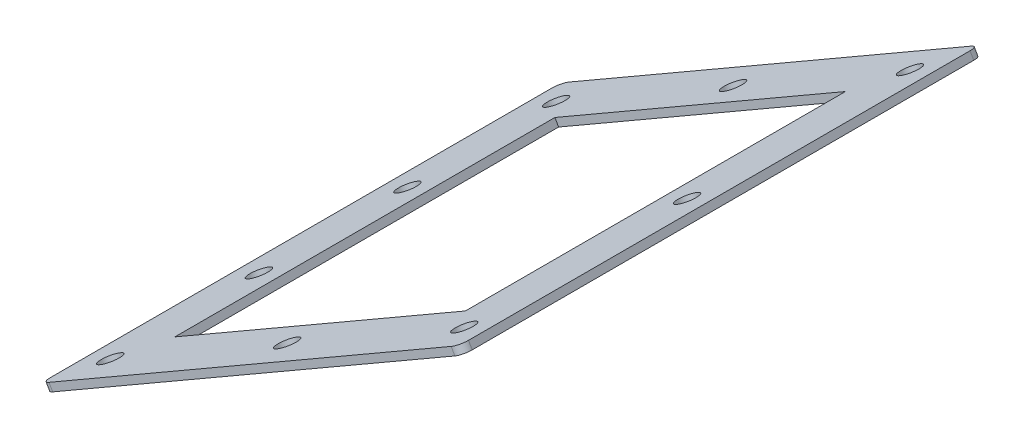
ISO-10303-21;
HEADER;
FILE_DESCRIPTION(('STEP AP214'),'2;1');
FILE_NAME('part.step','',(''),(''),'','','');
FILE_SCHEMA(('AUTOMOTIVE_DESIGN { 1 0 10303 214 1 1 1 1 }'));
ENDSEC;
DATA;
#1=APPLICATION_CONTEXT('core data for automotive mechanical design processes');
#2=APPLICATION_PROTOCOL_DEFINITION('international standard','automotive_design',2000,#1);
#3=PRODUCT_CONTEXT('',#1,'mechanical');
#4=PRODUCT('Part','Part','',(#3));
#5=PRODUCT_RELATED_PRODUCT_CATEGORY('part','',(#4));
#6=PRODUCT_DEFINITION_FORMATION('','',#4);
#7=PRODUCT_DEFINITION_CONTEXT('part definition',#1,'design');
#8=PRODUCT_DEFINITION('design','',#6,#7);
#9=PRODUCT_DEFINITION_SHAPE('','',#8);
#10=(LENGTH_UNIT() NAMED_UNIT(*) SI_UNIT(.MILLI.,.METRE.));
#11=(NAMED_UNIT(*) PLANE_ANGLE_UNIT() SI_UNIT($,.RADIAN.));
#12=(NAMED_UNIT(*) SI_UNIT($,.STERADIAN.) SOLID_ANGLE_UNIT());
#13=UNCERTAINTY_MEASURE_WITH_UNIT(LENGTH_MEASURE(1.E-05),#10,'distance_accuracy_value','');
#14=(GEOMETRIC_REPRESENTATION_CONTEXT(3) GLOBAL_UNCERTAINTY_ASSIGNED_CONTEXT((#13)) GLOBAL_UNIT_ASSIGNED_CONTEXT((#10,
#11,#12)) REPRESENTATION_CONTEXT('',''));
#15=CARTESIAN_POINT('',(0.,0.,0.));
#16=DIRECTION('',(0.,0.,1.));
#17=DIRECTION('',(1.,0.,0.));
#18=AXIS2_PLACEMENT_3D('',#15,#16,#17);
#19=CARTESIAN_POINT('',(1681.64736032422,3043.54507140033,140.));
#20=DIRECTION('',(0.866025403784435,0.500000000000006,0.));
#21=DIRECTION('',(0.,0.,-1.));
#22=AXIS2_PLACEMENT_3D('',#19,#20,#21);
#23=PLANE('',#22);
#24=DIRECTION('',(0.,0.,1.));
#25=VECTOR('',#24,1.);
#26=CARTESIAN_POINT('',(1683.64736032422,3040.0809697852,140.));
#27=LINE('',#26,#25);
#28=CARTESIAN_POINT('',(1683.64736032422,3040.0809697852,135.));
#29=VERTEX_POINT('',#28);
#30=CARTESIAN_POINT('',(1683.64736032422,3040.0809697852,-135.));
#31=VERTEX_POINT('',#30);
#32=EDGE_CURVE('E242',#29,#31,#27,.F.);
#33=ORIENTED_EDGE('',*,*,#32,.F.);
#34=DIRECTION('',(-0.500000000000006,0.866025403784435,0.));
#35=VECTOR('',#34,1.);
#36=CARTESIAN_POINT('',(1681.64736032422,3043.54507140033,135.));
#37=LINE('',#36,#35);
#38=CARTESIAN_POINT('',(1681.64736032422,3043.54507140033,135.));
#39=VERTEX_POINT('',#38);
#40=EDGE_CURVE('E274',#29,#39,#37,.T.);
#41=ORIENTED_EDGE('',*,*,#40,.T.);
#42=DIRECTION('',(0.,0.,-1.));
#43=VECTOR('',#42,1.);
#44=CARTESIAN_POINT('',(1681.64736032422,3043.54507140033,140.));
#45=LINE('',#44,#43);
#46=CARTESIAN_POINT('',(1681.64736032422,3043.54507140033,-135.));
#47=VERTEX_POINT('',#46);
#48=EDGE_CURVE('E230',#39,#47,#45,.T.);
#49=ORIENTED_EDGE('',*,*,#48,.T.);
#50=DIRECTION('',(0.500000000000006,-0.866025403784435,0.));
#51=VECTOR('',#50,1.);
#52=CARTESIAN_POINT('',(1681.64736032422,3043.54507140033,-135.));
#53=LINE('',#52,#51);
#54=EDGE_CURVE('E272',#47,#31,#53,.T.);
#55=ORIENTED_EDGE('',*,*,#54,.T.);
#56=EDGE_LOOP('',(#33,#41,#49,#55));
#57=FACE_BOUND('',#56,.T.);
#58=ADVANCED_FACE('F51',(#57),#23,.F.);
#59=CARTESIAN_POINT('',(1681.64736032422,3043.54507140033,140.));
#60=DIRECTION('',(0.,0.,1.));
#61=DIRECTION('',(0.866025403784435,0.500000000000006,0.));
#62=AXIS2_PLACEMENT_3D('',#59,#60,#61);
#63=PLANE('',#62);
#64=DIRECTION('',(-0.866025403784435,-0.500000000000006,0.));
#65=VECTOR('',#64,1.);
#66=CARTESIAN_POINT('',(1683.64736032422,3040.0809697852,140.));
#67=LINE('',#66,#65);
#68=CARTESIAN_POINT('',(1687.97748734315,3042.5809697852,140.));
#69=VERTEX_POINT('',#68);
#70=CARTESIAN_POINT('',(1904.48383828926,3167.5809697852,140.));
#71=VERTEX_POINT('',#70);
#72=EDGE_CURVE('E227',#69,#71,#67,.F.);
#73=ORIENTED_EDGE('',*,*,#72,.T.);
#74=DIRECTION('',(-0.500000000000006,0.866025403784435,0.));
#75=VECTOR('',#74,1.);
#76=CARTESIAN_POINT('',(1902.48383828926,3171.04507140033,140.));
#77=LINE('',#76,#75);
#78=CARTESIAN_POINT('',(1902.48383828926,3171.04507140033,140.));
#79=VERTEX_POINT('',#78);
#80=EDGE_CURVE('E248',#71,#79,#77,.T.);
#81=ORIENTED_EDGE('',*,*,#80,.T.);
#82=DIRECTION('',(0.866025403784435,0.500000000000006,0.));
#83=VECTOR('',#82,1.);
#84=CARTESIAN_POINT('',(1681.64736032422,3043.54507140033,140.));
#85=LINE('',#84,#83);
#86=CARTESIAN_POINT('',(1685.97748734315,3046.04507140033,140.));
#87=VERTEX_POINT('',#86);
#88=EDGE_CURVE('E233',#87,#79,#85,.T.);
#89=ORIENTED_EDGE('',*,*,#88,.F.);
#90=DIRECTION('',(0.500000000000006,-0.866025403784435,0.));
#91=VECTOR('',#90,1.);
#92=CARTESIAN_POINT('',(1685.97748734315,3046.04507140033,140.));
#93=LINE('',#92,#91);
#94=EDGE_CURVE('E236',#87,#69,#93,.T.);
#95=ORIENTED_EDGE('',*,*,#94,.T.);
#96=EDGE_LOOP('',(#73,#81,#89,#95));
#97=FACE_BOUND('',#96,.T.);
#98=ADVANCED_FACE('F305',(#97),#63,.T.);
#99=CARTESIAN_POINT('',(1906.81396530818,3173.54507140033,140.));
#100=DIRECTION('',(0.866025403784435,0.500000000000006,0.));
#101=DIRECTION('',(0.,0.,-1.));
#102=AXIS2_PLACEMENT_3D('',#99,#100,#101);
#103=PLANE('',#102);
#104=DIRECTION('',(0.,0.,-1.));
#105=VECTOR('',#104,1.);
#106=CARTESIAN_POINT('',(1906.81396530818,3173.54507140033,140.));
#107=LINE('',#106,#105);
#108=CARTESIAN_POINT('',(1906.81396530818,3173.54507140033,135.));
#109=VERTEX_POINT('',#108);
#110=CARTESIAN_POINT('',(1906.81396530818,3173.54507140033,-135.));
#111=VERTEX_POINT('',#110);
#112=EDGE_CURVE('E223',#109,#111,#107,.T.);
#113=ORIENTED_EDGE('',*,*,#112,.F.);
#114=DIRECTION('',(-0.500000000000006,0.866025403784435,0.));
#115=VECTOR('',#114,1.);
#116=CARTESIAN_POINT('',(1906.81396530818,3173.54507140033,135.));
#117=LINE('',#116,#115);
#118=CARTESIAN_POINT('',(1908.81396530818,3170.0809697852,135.));
#119=VERTEX_POINT('',#118);
#120=EDGE_CURVE('E262',#109,#119,#117,.F.);
#121=ORIENTED_EDGE('',*,*,#120,.T.);
#122=DIRECTION('',(0.,0.,1.));
#123=VECTOR('',#122,1.);
#124=CARTESIAN_POINT('',(1908.81396530818,3170.0809697852,140.));
#125=LINE('',#124,#123);
#126=CARTESIAN_POINT('',(1908.81396530818,3170.0809697852,-135.));
#127=VERTEX_POINT('',#126);
#128=EDGE_CURVE('E222',#119,#127,#125,.F.);
#129=ORIENTED_EDGE('',*,*,#128,.T.);
#130=DIRECTION('',(0.500000000000006,-0.866025403784435,0.));
#131=VECTOR('',#130,1.);
#132=CARTESIAN_POINT('',(1906.81396530818,3173.54507140033,-135.));
#133=LINE('',#132,#131);
#134=EDGE_CURVE('E259',#127,#111,#133,.F.);
#135=ORIENTED_EDGE('',*,*,#134,.T.);
#136=EDGE_LOOP('',(#113,#121,#129,#135));
#137=FACE_BOUND('',#136,.T.);
#138=ADVANCED_FACE('F311',(#137),#103,.T.);
#139=CARTESIAN_POINT('',(1681.64736032422,3043.54507140033,-140.));
#140=DIRECTION('',(0.,0.,1.));
#141=DIRECTION('',(0.866025403784435,0.500000000000006,0.));
#142=AXIS2_PLACEMENT_3D('',#139,#140,#141);
#143=PLANE('',#142);
#144=DIRECTION('',(-0.866025403784435,-0.500000000000006,0.));
#145=VECTOR('',#144,1.);
#146=CARTESIAN_POINT('',(1683.64736032422,3040.0809697852,-140.));
#147=LINE('',#146,#145);
#148=CARTESIAN_POINT('',(1687.97748734315,3042.5809697852,-140.));
#149=VERTEX_POINT('',#148);
#150=CARTESIAN_POINT('',(1904.48383828926,3167.5809697852,-140.));
#151=VERTEX_POINT('',#150);
#152=EDGE_CURVE('E239',#149,#151,#147,.F.);
#153=ORIENTED_EDGE('',*,*,#152,.F.);
#154=DIRECTION('',(0.500000000000006,-0.866025403784435,0.));
#155=VECTOR('',#154,1.);
#156=CARTESIAN_POINT('',(1685.97748734315,3046.04507140033,-140.));
#157=LINE('',#156,#155);
#158=CARTESIAN_POINT('',(1685.97748734315,3046.04507140033,-140.));
#159=VERTEX_POINT('',#158);
#160=EDGE_CURVE('E279',#149,#159,#157,.F.);
#161=ORIENTED_EDGE('',*,*,#160,.T.);
#162=DIRECTION('',(0.866025403784435,0.500000000000006,0.));
#163=VECTOR('',#162,1.);
#164=CARTESIAN_POINT('',(1681.64736032422,3043.54507140033,-140.));
#165=LINE('',#164,#163);
#166=CARTESIAN_POINT('',(1902.48383828926,3171.04507140033,-140.));
#167=VERTEX_POINT('',#166);
#168=EDGE_CURVE('E226',#159,#167,#165,.T.);
#169=ORIENTED_EDGE('',*,*,#168,.T.);
#170=DIRECTION('',(-0.500000000000006,0.866025403784435,0.));
#171=VECTOR('',#170,1.);
#172=CARTESIAN_POINT('',(1902.48383828926,3171.04507140033,-140.));
#173=LINE('',#172,#171);
#174=EDGE_CURVE('E277',#167,#151,#173,.F.);
#175=ORIENTED_EDGE('',*,*,#174,.T.);
#176=EDGE_LOOP('',(#153,#161,#169,#175));
#177=FACE_BOUND('',#176,.T.);
#178=ADVANCED_FACE('F317',(#177),#143,.F.);
#179=CARTESIAN_POINT('',(1681.64736032422,3043.54507140033,140.));
#180=DIRECTION('',(-0.500000000000006,0.866025403784435,0.));
#181=DIRECTION('',(-0.866025403784435,-0.500000000000006,0.));
#182=AXIS2_PLACEMENT_3D('',#179,#180,#181);
#183=PLANE('',#182);
#184=DIRECTION('',(-0.866025403784435,-0.500000000000005,0.));
#185=VECTOR('',#184,1.);
#186=CARTESIAN_POINT('',(1716.02856885446,3063.39507140033,-102.3));
#187=LINE('',#186,#185);
#188=CARTESIAN_POINT('',(1872.43275677793,3153.69507140033,-102.3));
#189=VERTEX_POINT('',#188);
#190=CARTESIAN_POINT('',(1716.02856885446,3063.39507140033,-102.3));
#191=VERTEX_POINT('',#190);
#192=EDGE_CURVE('E66',#189,#191,#187,.T.);
#193=ORIENTED_EDGE('',*,*,#192,.F.);
#194=DIRECTION('',(0.,0.,-1.));
#195=VECTOR('',#194,1.);
#196=CARTESIAN_POINT('',(1872.43275677793,3153.69507140033,-102.3));
#197=LINE('',#196,#195);
#198=CARTESIAN_POINT('',(1872.43275677793,3153.69507140033,102.3));
#199=VERTEX_POINT('',#198);
#200=EDGE_CURVE('E159',#199,#189,#197,.T.);
#201=ORIENTED_EDGE('',*,*,#200,.F.);
#202=DIRECTION('',(0.866025403784435,0.500000000000005,0.));
#203=VECTOR('',#202,1.);
#204=CARTESIAN_POINT('',(1716.02856885446,3063.39507140033,102.3));
#205=LINE('',#204,#203);
#206=CARTESIAN_POINT('',(1716.02856885446,3063.39507140033,102.3));
#207=VERTEX_POINT('',#206);
#208=EDGE_CURVE('E143',#207,#199,#205,.T.);
#209=ORIENTED_EDGE('',*,*,#208,.F.);
#210=DIRECTION('',(0.,0.,1.));
#211=VECTOR('',#210,1.);
#212=CARTESIAN_POINT('',(1716.02856885446,3063.39507140033,-102.3));
#213=LINE('',#212,#211);
#214=EDGE_CURVE('E152',#191,#207,#213,.T.);
#215=ORIENTED_EDGE('',*,*,#214,.F.);
#216=EDGE_LOOP('',(#193,#201,#209,#215));
#217=FACE_BOUND('',#216,.T.);
#218=CARTESIAN_POINT('',(1698.96786839991,3053.54507140033,120.));
#219=DIRECTION('',(-0.500000000000006,0.866025403784435,0.));
#220=DIRECTION('',(-0.866025403784435,-0.500000000000006,0.));
#221=AXIS2_PLACEMENT_3D('',#218,#219,#220);
#222=CIRCLE('',#221,5.60000000000001);
#223=CARTESIAN_POINT('',(1694.11812613872,3050.74507140033,120.));
#224=VERTEX_POINT('',#223);
#225=EDGE_CURVE('E166',#224,#224,#222,.T.);
#226=ORIENTED_EDGE('',*,*,#225,.F.);
#227=EDGE_LOOP('',(#226));
#228=FACE_BOUND('',#227,.T.);
#229=CARTESIAN_POINT('',(1698.96786839991,3053.54507140033,40.));
#230=DIRECTION('',(-0.500000000000006,0.866025403784435,0.));
#231=DIRECTION('',(-0.866025403784435,-0.500000000000006,0.));
#232=AXIS2_PLACEMENT_3D('',#229,#230,#231);
#233=CIRCLE('',#232,5.59999999999999);
#234=CARTESIAN_POINT('',(1694.11812613872,3050.74507140033,40.));
#235=VERTEX_POINT('',#234);
#236=EDGE_CURVE('E174',#235,#235,#233,.T.);
#237=ORIENTED_EDGE('',*,*,#236,.F.);
#238=EDGE_LOOP('',(#237));
#239=FACE_BOUND('',#238,.T.);
#240=CARTESIAN_POINT('',(1698.96786839991,3053.54507140033,-40.));
#241=DIRECTION('',(-0.500000000000006,0.866025403784435,0.));
#242=DIRECTION('',(-0.866025403784435,-0.500000000000006,0.));
#243=AXIS2_PLACEMENT_3D('',#240,#241,#242);
#244=CIRCLE('',#243,5.59999999999999);
#245=CARTESIAN_POINT('',(1694.11812613872,3050.74507140033,-40.));
#246=VERTEX_POINT('',#245);
#247=EDGE_CURVE('E180',#246,#246,#244,.T.);
#248=ORIENTED_EDGE('',*,*,#247,.F.);
#249=EDGE_LOOP('',(#248));
#250=FACE_BOUND('',#249,.T.);
#251=CARTESIAN_POINT('',(1794.2306628162,3108.54507140033,-120.));
#252=DIRECTION('',(-0.500000000000006,0.866025403784435,0.));
#253=DIRECTION('',(-0.866025403784435,-0.500000000000006,0.));
#254=AXIS2_PLACEMENT_3D('',#251,#252,#253);
#255=CIRCLE('',#254,5.59999999999999);
#256=CARTESIAN_POINT('',(1789.38092055501,3105.74507140033,-120.));
#257=VERTEX_POINT('',#256);
#258=EDGE_CURVE('E186',#257,#257,#255,.T.);
#259=ORIENTED_EDGE('',*,*,#258,.F.);
#260=EDGE_LOOP('',(#259));
#261=FACE_BOUND('',#260,.T.);
#262=CARTESIAN_POINT('',(1698.96786839991,3053.54507140033,-120.));
#263=DIRECTION('',(-0.500000000000006,0.866025403784435,0.));
#264=DIRECTION('',(-0.866025403784435,-0.500000000000006,0.));
#265=AXIS2_PLACEMENT_3D('',#262,#263,#264);
#266=CIRCLE('',#265,5.59999999999999);
#267=CARTESIAN_POINT('',(1694.11812613872,3050.74507140033,-120.));
#268=VERTEX_POINT('',#267);
#269=EDGE_CURVE('E192',#268,#268,#266,.T.);
#270=ORIENTED_EDGE('',*,*,#269,.F.);
#271=EDGE_LOOP('',(#270));
#272=FACE_BOUND('',#271,.T.);
#273=CARTESIAN_POINT('',(1889.49345723249,3163.54507140033,-120.));
#274=DIRECTION('',(-0.500000000000006,0.866025403784435,0.));
#275=DIRECTION('',(-0.866025403784435,-0.500000000000006,0.));
#276=AXIS2_PLACEMENT_3D('',#273,#274,#275);
#277=CIRCLE('',#276,5.59999999999999);
#278=CARTESIAN_POINT('',(1884.6437149713,3160.74507140033,-120.));
#279=VERTEX_POINT('',#278);
#280=EDGE_CURVE('E198',#279,#279,#277,.T.);
#281=ORIENTED_EDGE('',*,*,#280,.F.);
#282=EDGE_LOOP('',(#281));
#283=FACE_BOUND('',#282,.T.);
#284=CARTESIAN_POINT('',(1889.49345723249,3163.54507140033,0.));
#285=DIRECTION('',(-0.500000000000006,0.866025403784435,0.));
#286=DIRECTION('',(-0.866025403784435,-0.500000000000006,0.));
#287=AXIS2_PLACEMENT_3D('',#284,#285,#286);
#288=CIRCLE('',#287,5.59999999999999);
#289=CARTESIAN_POINT('',(1884.6437149713,3160.74507140033,0.));
#290=VERTEX_POINT('',#289);
#291=EDGE_CURVE('E204',#290,#290,#288,.T.);
#292=ORIENTED_EDGE('',*,*,#291,.F.);
#293=EDGE_LOOP('',(#292));
#294=FACE_BOUND('',#293,.T.);
#295=CARTESIAN_POINT('',(1889.49345723249,3163.54507140033,120.));
#296=DIRECTION('',(-0.500000000000006,0.866025403784435,0.));
#297=DIRECTION('',(-0.866025403784435,-0.500000000000006,0.));
#298=AXIS2_PLACEMENT_3D('',#295,#296,#297);
#299=CIRCLE('',#298,5.60000000000001);
#300=CARTESIAN_POINT('',(1884.6437149713,3160.74507140033,120.));
#301=VERTEX_POINT('',#300);
#302=EDGE_CURVE('E210',#301,#301,#299,.T.);
#303=ORIENTED_EDGE('',*,*,#302,.F.);
#304=EDGE_LOOP('',(#303));
#305=FACE_BOUND('',#304,.T.);
#306=CARTESIAN_POINT('',(1794.2306628162,3108.54507140033,120.));
#307=DIRECTION('',(-0.500000000000006,0.866025403784435,0.));
#308=DIRECTION('',(-0.866025403784435,-0.500000000000006,0.));
#309=AXIS2_PLACEMENT_3D('',#306,#307,#308);
#310=CIRCLE('',#309,5.60000000000001);
#311=CARTESIAN_POINT('',(1789.38092055501,3105.74507140033,120.));
#312=VERTEX_POINT('',#311);
#313=EDGE_CURVE('E216',#312,#312,#310,.T.);
#314=ORIENTED_EDGE('',*,*,#313,.F.);
#315=EDGE_LOOP('',(#314));
#316=FACE_BOUND('',#315,.T.);
#317=ORIENTED_EDGE('',*,*,#88,.T.);
#318=CARTESIAN_POINT('',(1902.48383828926,3171.04507140033,135.));
#319=DIRECTION('',(-0.500000000000006,0.866025403784435,0.));
#320=DIRECTION('',(-0.866025403784435,-0.500000000000006,0.));
#321=AXIS2_PLACEMENT_3D('',#318,#319,#320);
#322=CIRCLE('',#321,5.);
#323=EDGE_CURVE('E257',#79,#109,#322,.T.);
#324=ORIENTED_EDGE('',*,*,#323,.T.);
#325=ORIENTED_EDGE('',*,*,#112,.T.);
#326=CARTESIAN_POINT('',(1902.48383828926,3171.04507140033,-135.));
#327=DIRECTION('',(-0.500000000000006,0.866025403784435,0.));
#328=DIRECTION('',(-0.866025403784435,-0.500000000000006,0.));
#329=AXIS2_PLACEMENT_3D('',#326,#327,#328);
#330=CIRCLE('',#329,5.);
#331=EDGE_CURVE('E251',#111,#167,#330,.T.);
#332=ORIENTED_EDGE('',*,*,#331,.T.);
#333=ORIENTED_EDGE('',*,*,#168,.F.);
#334=CARTESIAN_POINT('',(1685.97748734315,3046.04507140033,-135.));
#335=DIRECTION('',(-0.500000000000006,0.866025403784435,0.));
#336=DIRECTION('',(-0.866025403784435,-0.500000000000006,0.));
#337=AXIS2_PLACEMENT_3D('',#334,#335,#336);
#338=CIRCLE('',#337,5.);
#339=EDGE_CURVE('E253',#159,#47,#338,.T.);
#340=ORIENTED_EDGE('',*,*,#339,.T.);
#341=ORIENTED_EDGE('',*,*,#48,.F.);
#342=CARTESIAN_POINT('',(1685.97748734315,3046.04507140033,135.));
#343=DIRECTION('',(-0.500000000000006,0.866025403784435,0.));
#344=DIRECTION('',(-0.866025403784435,-0.500000000000006,0.));
#345=AXIS2_PLACEMENT_3D('',#342,#343,#344);
#346=CIRCLE('',#345,5.);
#347=EDGE_CURVE('E255',#39,#87,#346,.T.);
#348=ORIENTED_EDGE('',*,*,#347,.T.);
#349=EDGE_LOOP('',(#317,#324,#325,#332,#333,#340,#341,#348));
#350=FACE_BOUND('',#349,.T.);
#351=ADVANCED_FACE('F156',(#217,#228,#239,#250,#261,#272,#283,#294,#305,#316,#350),#183,.T.);
#352=CARTESIAN_POINT('',(1683.64736032422,3040.0809697852,140.));
#353=DIRECTION('',(-0.500000000000006,0.866025403784435,0.));
#354=DIRECTION('',(-0.866025403784435,-0.500000000000006,0.));
#355=AXIS2_PLACEMENT_3D('',#352,#353,#354);
#356=PLANE('',#355);
#357=DIRECTION('',(0.,0.,-1.));
#358=VECTOR('',#357,1.);
#359=CARTESIAN_POINT('',(1874.43275677793,3150.23096978519,140.));
#360=LINE('',#359,#358);
#361=CARTESIAN_POINT('',(1874.43275677793,3150.23096978519,102.3));
#362=VERTEX_POINT('',#361);
#363=CARTESIAN_POINT('',(1874.43275677793,3150.23096978519,-102.3));
#364=VERTEX_POINT('',#363);
#365=EDGE_CURVE('E59',#362,#364,#360,.T.);
#366=ORIENTED_EDGE('',*,*,#365,.T.);
#367=DIRECTION('',(-0.866025403784435,-0.500000000000006,0.));
#368=VECTOR('',#367,1.);
#369=CARTESIAN_POINT('',(1683.64736032422,3040.0809697852,-102.3));
#370=LINE('',#369,#368);
#371=CARTESIAN_POINT('',(1718.02856885446,3059.93096978519,-102.3));
#372=VERTEX_POINT('',#371);
#373=EDGE_CURVE('E13',#364,#372,#370,.T.);
#374=ORIENTED_EDGE('',*,*,#373,.T.);
#375=DIRECTION('',(0.,0.,1.));
#376=VECTOR('',#375,1.);
#377=CARTESIAN_POINT('',(1718.02856885446,3059.93096978519,140.));
#378=LINE('',#377,#376);
#379=CARTESIAN_POINT('',(1718.02856885446,3059.93096978519,102.3));
#380=VERTEX_POINT('',#379);
#381=EDGE_CURVE('E282',#372,#380,#378,.T.);
#382=ORIENTED_EDGE('',*,*,#381,.T.);
#383=DIRECTION('',(0.866025403784435,0.500000000000006,0.));
#384=VECTOR('',#383,1.);
#385=CARTESIAN_POINT('',(1683.64736032422,3040.0809697852,102.3));
#386=LINE('',#385,#384);
#387=EDGE_CURVE('E146',#380,#362,#386,.T.);
#388=ORIENTED_EDGE('',*,*,#387,.T.);
#389=EDGE_LOOP('',(#366,#374,#382,#388));
#390=FACE_BOUND('',#389,.T.);
#391=CARTESIAN_POINT('',(1700.96786839991,3050.08096978519,120.));
#392=DIRECTION('',(-0.500000000000006,0.866025403784435,0.));
#393=DIRECTION('',(-0.866025403784435,-0.500000000000006,0.));
#394=AXIS2_PLACEMENT_3D('',#391,#392,#393);
#395=CIRCLE('',#394,5.59999999999999);
#396=CARTESIAN_POINT('',(1696.11812613872,3047.28096978519,120.));
#397=VERTEX_POINT('',#396);
#398=EDGE_CURVE('E171',#397,#397,#395,.T.);
#399=ORIENTED_EDGE('',*,*,#398,.T.);
#400=EDGE_LOOP('',(#399));
#401=FACE_BOUND('',#400,.T.);
#402=CARTESIAN_POINT('',(1700.96786839991,3050.08096978519,40.));
#403=DIRECTION('',(-0.500000000000006,0.866025403784435,0.));
#404=DIRECTION('',(-0.866025403784435,-0.500000000000006,0.));
#405=AXIS2_PLACEMENT_3D('',#402,#403,#404);
#406=CIRCLE('',#405,5.59999999999999);
#407=CARTESIAN_POINT('',(1696.11812613872,3047.28096978519,40.));
#408=VERTEX_POINT('',#407);
#409=EDGE_CURVE('E177',#408,#408,#406,.T.);
#410=ORIENTED_EDGE('',*,*,#409,.T.);
#411=EDGE_LOOP('',(#410));
#412=FACE_BOUND('',#411,.T.);
#413=CARTESIAN_POINT('',(1700.96786839991,3050.08096978519,-40.));
#414=DIRECTION('',(-0.500000000000006,0.866025403784435,0.));
#415=DIRECTION('',(-0.866025403784435,-0.500000000000006,0.));
#416=AXIS2_PLACEMENT_3D('',#413,#414,#415);
#417=CIRCLE('',#416,5.59999999999999);
#418=CARTESIAN_POINT('',(1696.11812613872,3047.28096978519,-40.));
#419=VERTEX_POINT('',#418);
#420=EDGE_CURVE('E183',#419,#419,#417,.T.);
#421=ORIENTED_EDGE('',*,*,#420,.T.);
#422=EDGE_LOOP('',(#421));
#423=FACE_BOUND('',#422,.T.);
#424=CARTESIAN_POINT('',(1796.2306628162,3105.0809697852,-120.));
#425=DIRECTION('',(-0.500000000000006,0.866025403784435,0.));
#426=DIRECTION('',(-0.866025403784435,-0.500000000000006,0.));
#427=AXIS2_PLACEMENT_3D('',#424,#425,#426);
#428=CIRCLE('',#427,5.59999999999999);
#429=CARTESIAN_POINT('',(1791.38092055501,3102.2809697852,-120.));
#430=VERTEX_POINT('',#429);
#431=EDGE_CURVE('E189',#430,#430,#428,.T.);
#432=ORIENTED_EDGE('',*,*,#431,.T.);
#433=EDGE_LOOP('',(#432));
#434=FACE_BOUND('',#433,.T.);
#435=CARTESIAN_POINT('',(1700.96786839991,3050.08096978519,-120.));
#436=DIRECTION('',(-0.500000000000006,0.866025403784435,0.));
#437=DIRECTION('',(-0.866025403784435,-0.500000000000006,0.));
#438=AXIS2_PLACEMENT_3D('',#435,#436,#437);
#439=CIRCLE('',#438,5.59999999999999);
#440=CARTESIAN_POINT('',(1696.11812613872,3047.28096978519,-120.));
#441=VERTEX_POINT('',#440);
#442=EDGE_CURVE('E195',#441,#441,#439,.T.);
#443=ORIENTED_EDGE('',*,*,#442,.T.);
#444=EDGE_LOOP('',(#443));
#445=FACE_BOUND('',#444,.T.);
#446=CARTESIAN_POINT('',(1891.49345723249,3160.0809697852,-120.));
#447=DIRECTION('',(-0.500000000000006,0.866025403784435,0.));
#448=DIRECTION('',(-0.866025403784435,-0.500000000000006,0.));
#449=AXIS2_PLACEMENT_3D('',#446,#447,#448);
#450=CIRCLE('',#449,5.59999999999999);
#451=CARTESIAN_POINT('',(1886.6437149713,3157.2809697852,-120.));
#452=VERTEX_POINT('',#451);
#453=EDGE_CURVE('E201',#452,#452,#450,.T.);
#454=ORIENTED_EDGE('',*,*,#453,.T.);
#455=EDGE_LOOP('',(#454));
#456=FACE_BOUND('',#455,.T.);
#457=CARTESIAN_POINT('',(1891.49345723249,3160.0809697852,0.));
#458=DIRECTION('',(-0.500000000000006,0.866025403784435,0.));
#459=DIRECTION('',(-0.866025403784435,-0.500000000000006,0.));
#460=AXIS2_PLACEMENT_3D('',#457,#458,#459);
#461=CIRCLE('',#460,5.59999999999999);
#462=CARTESIAN_POINT('',(1886.6437149713,3157.2809697852,0.));
#463=VERTEX_POINT('',#462);
#464=EDGE_CURVE('E207',#463,#463,#461,.T.);
#465=ORIENTED_EDGE('',*,*,#464,.T.);
#466=EDGE_LOOP('',(#465));
#467=FACE_BOUND('',#466,.T.);
#468=CARTESIAN_POINT('',(1891.49345723249,3160.0809697852,120.));
#469=DIRECTION('',(-0.500000000000006,0.866025403784435,0.));
#470=DIRECTION('',(-0.866025403784435,-0.500000000000006,0.));
#471=AXIS2_PLACEMENT_3D('',#468,#469,#470);
#472=CIRCLE('',#471,5.59999999999999);
#473=CARTESIAN_POINT('',(1886.6437149713,3157.2809697852,120.));
#474=VERTEX_POINT('',#473);
#475=EDGE_CURVE('E213',#474,#474,#472,.T.);
#476=ORIENTED_EDGE('',*,*,#475,.T.);
#477=EDGE_LOOP('',(#476));
#478=FACE_BOUND('',#477,.T.);
#479=CARTESIAN_POINT('',(1796.2306628162,3105.0809697852,120.));
#480=DIRECTION('',(-0.500000000000006,0.866025403784435,0.));
#481=DIRECTION('',(-0.866025403784435,-0.500000000000006,0.));
#482=AXIS2_PLACEMENT_3D('',#479,#480,#481);
#483=CIRCLE('',#482,5.59999999999999);
#484=CARTESIAN_POINT('',(1791.38092055501,3102.2809697852,120.));
#485=VERTEX_POINT('',#484);
#486=EDGE_CURVE('E219',#485,#485,#483,.T.);
#487=ORIENTED_EDGE('',*,*,#486,.T.);
#488=EDGE_LOOP('',(#487));
#489=FACE_BOUND('',#488,.T.);
#490=ORIENTED_EDGE('',*,*,#128,.F.);
#491=CARTESIAN_POINT('',(1904.48383828926,3167.5809697852,135.));
#492=DIRECTION('',(-0.500000000000006,0.866025403784435,0.));
#493=DIRECTION('',(-0.866025403784435,-0.500000000000006,0.));
#494=AXIS2_PLACEMENT_3D('',#491,#492,#493);
#495=CIRCLE('',#494,5.);
#496=EDGE_CURVE('E270',#119,#71,#495,.F.);
#497=ORIENTED_EDGE('',*,*,#496,.T.);
#498=ORIENTED_EDGE('',*,*,#72,.F.);
#499=CARTESIAN_POINT('',(1687.97748734315,3042.5809697852,135.));
#500=DIRECTION('',(-0.500000000000006,0.866025403784435,0.));
#501=DIRECTION('',(-0.866025403784435,-0.500000000000006,0.));
#502=AXIS2_PLACEMENT_3D('',#499,#500,#501);
#503=CIRCLE('',#502,5.);
#504=EDGE_CURVE('E268',#69,#29,#503,.F.);
#505=ORIENTED_EDGE('',*,*,#504,.T.);
#506=ORIENTED_EDGE('',*,*,#32,.T.);
#507=CARTESIAN_POINT('',(1687.97748734315,3042.5809697852,-135.));
#508=DIRECTION('',(-0.500000000000006,0.866025403784435,0.));
#509=DIRECTION('',(-0.866025403784435,-0.500000000000006,0.));
#510=AXIS2_PLACEMENT_3D('',#507,#508,#509);
#511=CIRCLE('',#510,5.);
#512=EDGE_CURVE('E266',#31,#149,#511,.F.);
#513=ORIENTED_EDGE('',*,*,#512,.T.);
#514=ORIENTED_EDGE('',*,*,#152,.T.);
#515=CARTESIAN_POINT('',(1904.48383828926,3167.5809697852,-135.));
#516=DIRECTION('',(-0.500000000000006,0.866025403784435,0.));
#517=DIRECTION('',(-0.866025403784435,-0.500000000000006,0.));
#518=AXIS2_PLACEMENT_3D('',#515,#516,#517);
#519=CIRCLE('',#518,5.);
#520=EDGE_CURVE('E264',#151,#127,#519,.F.);
#521=ORIENTED_EDGE('',*,*,#520,.T.);
#522=EDGE_LOOP('',(#490,#497,#498,#505,#506,#513,#514,#521));
#523=FACE_BOUND('',#522,.T.);
#524=ADVANCED_FACE('F286',(#390,#401,#412,#423,#434,#445,#456,#467,#478,#489,#523),#356,.F.);
#525=CARTESIAN_POINT('',(1902.48383828926,3171.04507140033,135.));
#526=DIRECTION('',(-0.500000000000006,0.866025403784435,0.));
#527=DIRECTION('',(-0.866025403784435,-0.500000000000006,0.));
#528=AXIS2_PLACEMENT_3D('',#525,#526,#527);
#529=CYLINDRICAL_SURFACE('',#528,5.);
#530=ORIENTED_EDGE('',*,*,#496,.F.);
#531=ORIENTED_EDGE('',*,*,#120,.F.);
#532=ORIENTED_EDGE('',*,*,#323,.F.);
#533=ORIENTED_EDGE('',*,*,#80,.F.);
#534=EDGE_LOOP('',(#530,#531,#532,#533));
#535=FACE_BOUND('',#534,.T.);
#536=ADVANCED_FACE('F321',(#535),#529,.T.);
#537=CARTESIAN_POINT('',(1685.97748734315,3046.04507140033,135.));
#538=DIRECTION('',(0.500000000000006,-0.866025403784435,0.));
#539=DIRECTION('',(0.866025403784435,0.500000000000006,0.));
#540=AXIS2_PLACEMENT_3D('',#537,#538,#539);
#541=CYLINDRICAL_SURFACE('',#540,5.);
#542=ORIENTED_EDGE('',*,*,#504,.F.);
#543=ORIENTED_EDGE('',*,*,#94,.F.);
#544=ORIENTED_EDGE('',*,*,#347,.F.);
#545=ORIENTED_EDGE('',*,*,#40,.F.);
#546=EDGE_LOOP('',(#542,#543,#544,#545));
#547=FACE_BOUND('',#546,.T.);
#548=ADVANCED_FACE('F324',(#547),#541,.T.);
#549=CARTESIAN_POINT('',(1685.97748734315,3046.04507140033,-135.));
#550=DIRECTION('',(-0.500000000000006,0.866025403784435,0.));
#551=DIRECTION('',(-0.866025403784435,-0.500000000000006,0.));
#552=AXIS2_PLACEMENT_3D('',#549,#550,#551);
#553=CYLINDRICAL_SURFACE('',#552,5.);
#554=ORIENTED_EDGE('',*,*,#512,.F.);
#555=ORIENTED_EDGE('',*,*,#54,.F.);
#556=ORIENTED_EDGE('',*,*,#339,.F.);
#557=ORIENTED_EDGE('',*,*,#160,.F.);
#558=EDGE_LOOP('',(#554,#555,#556,#557));
#559=FACE_BOUND('',#558,.T.);
#560=ADVANCED_FACE('F327',(#559),#553,.T.);
#561=CARTESIAN_POINT('',(1902.48383828926,3171.04507140033,-135.));
#562=DIRECTION('',(0.500000000000006,-0.866025403784435,0.));
#563=DIRECTION('',(0.866025403784435,0.500000000000006,0.));
#564=AXIS2_PLACEMENT_3D('',#561,#562,#563);
#565=CYLINDRICAL_SURFACE('',#564,5.);
#566=ORIENTED_EDGE('',*,*,#520,.F.);
#567=ORIENTED_EDGE('',*,*,#174,.F.);
#568=ORIENTED_EDGE('',*,*,#331,.F.);
#569=ORIENTED_EDGE('',*,*,#134,.F.);
#570=EDGE_LOOP('',(#566,#567,#568,#569));
#571=FACE_BOUND('',#570,.T.);
#572=ADVANCED_FACE('F53',(#571),#565,.T.);
#573=CARTESIAN_POINT('',(1794.2306628162,3108.54507140033,120.));
#574=DIRECTION('',(-0.500000000000006,0.866025403784435,0.));
#575=DIRECTION('',(-0.866025403784435,-0.500000000000006,0.));
#576=AXIS2_PLACEMENT_3D('',#573,#574,#575);
#577=CYLINDRICAL_SURFACE('',#576,5.59999999999999);
#578=ORIENTED_EDGE('',*,*,#313,.T.);
#579=EDGE_LOOP('',(#578));
#580=FACE_BOUND('',#579,.T.);
#581=ORIENTED_EDGE('',*,*,#486,.F.);
#582=EDGE_LOOP('',(#581));
#583=FACE_BOUND('',#582,.T.);
#584=ADVANCED_FACE('F334',(#580,#583),#577,.F.);
#585=CARTESIAN_POINT('',(1889.49345723249,3163.54507140033,120.));
#586=DIRECTION('',(-0.500000000000006,0.866025403784435,0.));
#587=DIRECTION('',(-0.866025403784435,-0.500000000000006,0.));
#588=AXIS2_PLACEMENT_3D('',#585,#586,#587);
#589=CYLINDRICAL_SURFACE('',#588,5.59999999999999);
#590=ORIENTED_EDGE('',*,*,#302,.T.);
#591=EDGE_LOOP('',(#590));
#592=FACE_BOUND('',#591,.T.);
#593=ORIENTED_EDGE('',*,*,#475,.F.);
#594=EDGE_LOOP('',(#593));
#595=FACE_BOUND('',#594,.T.);
#596=ADVANCED_FACE('F418',(#592,#595),#589,.F.);
#597=CARTESIAN_POINT('',(1889.49345723249,3163.54507140033,0.));
#598=DIRECTION('',(-0.500000000000006,0.866025403784435,0.));
#599=DIRECTION('',(-0.866025403784435,-0.500000000000006,0.));
#600=AXIS2_PLACEMENT_3D('',#597,#598,#599);
#601=CYLINDRICAL_SURFACE('',#600,5.59999999999999);
#602=ORIENTED_EDGE('',*,*,#291,.T.);
#603=EDGE_LOOP('',(#602));
#604=FACE_BOUND('',#603,.T.);
#605=ORIENTED_EDGE('',*,*,#464,.F.);
#606=EDGE_LOOP('',(#605));
#607=FACE_BOUND('',#606,.T.);
#608=ADVANCED_FACE('F427',(#604,#607),#601,.F.);
#609=CARTESIAN_POINT('',(1889.49345723249,3163.54507140033,-120.));
#610=DIRECTION('',(-0.500000000000006,0.866025403784435,0.));
#611=DIRECTION('',(-0.866025403784435,-0.500000000000006,0.));
#612=AXIS2_PLACEMENT_3D('',#609,#610,#611);
#613=CYLINDRICAL_SURFACE('',#612,5.59999999999999);
#614=ORIENTED_EDGE('',*,*,#280,.T.);
#615=EDGE_LOOP('',(#614));
#616=FACE_BOUND('',#615,.T.);
#617=ORIENTED_EDGE('',*,*,#453,.F.);
#618=EDGE_LOOP('',(#617));
#619=FACE_BOUND('',#618,.T.);
#620=ADVANCED_FACE('F436',(#616,#619),#613,.F.);
#621=CARTESIAN_POINT('',(1698.96786839991,3053.54507140033,-120.));
#622=DIRECTION('',(-0.500000000000006,0.866025403784435,0.));
#623=DIRECTION('',(-0.866025403784435,-0.500000000000006,0.));
#624=AXIS2_PLACEMENT_3D('',#621,#622,#623);
#625=CYLINDRICAL_SURFACE('',#624,5.59999999999999);
#626=ORIENTED_EDGE('',*,*,#269,.T.);
#627=EDGE_LOOP('',(#626));
#628=FACE_BOUND('',#627,.T.);
#629=ORIENTED_EDGE('',*,*,#442,.F.);
#630=EDGE_LOOP('',(#629));
#631=FACE_BOUND('',#630,.T.);
#632=ADVANCED_FACE('F446',(#628,#631),#625,.F.);
#633=CARTESIAN_POINT('',(1794.2306628162,3108.54507140033,-120.));
#634=DIRECTION('',(-0.500000000000006,0.866025403784435,0.));
#635=DIRECTION('',(-0.866025403784435,-0.500000000000006,0.));
#636=AXIS2_PLACEMENT_3D('',#633,#634,#635);
#637=CYLINDRICAL_SURFACE('',#636,5.59999999999999);
#638=ORIENTED_EDGE('',*,*,#258,.T.);
#639=EDGE_LOOP('',(#638));
#640=FACE_BOUND('',#639,.T.);
#641=ORIENTED_EDGE('',*,*,#431,.F.);
#642=EDGE_LOOP('',(#641));
#643=FACE_BOUND('',#642,.T.);
#644=ADVANCED_FACE('F456',(#640,#643),#637,.F.);
#645=CARTESIAN_POINT('',(1698.96786839991,3053.54507140033,-40.));
#646=DIRECTION('',(-0.500000000000006,0.866025403784435,0.));
#647=DIRECTION('',(-0.866025403784435,-0.500000000000006,0.));
#648=AXIS2_PLACEMENT_3D('',#645,#646,#647);
#649=CYLINDRICAL_SURFACE('',#648,5.59999999999999);
#650=ORIENTED_EDGE('',*,*,#247,.T.);
#651=EDGE_LOOP('',(#650));
#652=FACE_BOUND('',#651,.T.);
#653=ORIENTED_EDGE('',*,*,#420,.F.);
#654=EDGE_LOOP('',(#653));
#655=FACE_BOUND('',#654,.T.);
#656=ADVANCED_FACE('F466',(#652,#655),#649,.F.);
#657=CARTESIAN_POINT('',(1698.96786839991,3053.54507140033,40.));
#658=DIRECTION('',(-0.500000000000006,0.866025403784435,0.));
#659=DIRECTION('',(-0.866025403784435,-0.500000000000006,0.));
#660=AXIS2_PLACEMENT_3D('',#657,#658,#659);
#661=CYLINDRICAL_SURFACE('',#660,5.59999999999999);
#662=ORIENTED_EDGE('',*,*,#236,.T.);
#663=EDGE_LOOP('',(#662));
#664=FACE_BOUND('',#663,.T.);
#665=ORIENTED_EDGE('',*,*,#409,.F.);
#666=EDGE_LOOP('',(#665));
#667=FACE_BOUND('',#666,.T.);
#668=ADVANCED_FACE('F300',(#664,#667),#661,.F.);
#669=CARTESIAN_POINT('',(1698.96786839991,3053.54507140033,120.));
#670=DIRECTION('',(-0.500000000000006,0.866025403784435,0.));
#671=DIRECTION('',(-0.866025403784435,-0.500000000000006,0.));
#672=AXIS2_PLACEMENT_3D('',#669,#670,#671);
#673=CYLINDRICAL_SURFACE('',#672,5.59999999999999);
#674=ORIENTED_EDGE('',*,*,#225,.T.);
#675=EDGE_LOOP('',(#674));
#676=FACE_BOUND('',#675,.T.);
#677=ORIENTED_EDGE('',*,*,#398,.F.);
#678=EDGE_LOOP('',(#677));
#679=FACE_BOUND('',#678,.T.);
#680=ADVANCED_FACE('F293',(#676,#679),#673,.F.);
#681=CARTESIAN_POINT('',(1719.52856885446,3057.33289357384,-102.3));
#682=DIRECTION('',(0.,0.,-1.));
#683=DIRECTION('',(-1.,0.,0.));
#684=AXIS2_PLACEMENT_3D('',#681,#682,#683);
#685=PLANE('',#684);
#686=DIRECTION('',(-0.500000000000006,0.866025403784435,0.));
#687=VECTOR('',#686,1.);
#688=CARTESIAN_POINT('',(1875.93275677793,3147.63289357384,-102.3));
#689=LINE('',#688,#687);
#690=EDGE_CURVE('E164',#364,#189,#689,.T.);
#691=ORIENTED_EDGE('',*,*,#690,.T.);
#692=ORIENTED_EDGE('',*,*,#192,.T.);
#693=DIRECTION('',(-0.500000000000006,0.866025403784435,0.));
#694=VECTOR('',#693,1.);
#695=CARTESIAN_POINT('',(1719.52856885446,3057.33289357384,-102.3));
#696=LINE('',#695,#694);
#697=EDGE_CURVE('E149',#372,#191,#696,.T.);
#698=ORIENTED_EDGE('',*,*,#697,.F.);
#699=ORIENTED_EDGE('',*,*,#373,.F.);
#700=EDGE_LOOP('',(#691,#692,#698,#699));
#701=FACE_BOUND('',#700,.T.);
#702=ADVANCED_FACE('F291',(#701),#685,.F.);
#703=CARTESIAN_POINT('',(1875.93275677793,3147.63289357384,-102.3));
#704=DIRECTION('',(0.866025403784435,0.500000000000006,0.));
#705=DIRECTION('',(-0.500000000000006,0.866025403784435,0.));
#706=AXIS2_PLACEMENT_3D('',#703,#704,#705);
#707=PLANE('',#706);
#708=DIRECTION('',(-0.500000000000006,0.866025403784435,0.));
#709=VECTOR('',#708,1.);
#710=CARTESIAN_POINT('',(1875.93275677793,3147.63289357384,102.3));
#711=LINE('',#710,#709);
#712=EDGE_CURVE('E148',#362,#199,#711,.T.);
#713=ORIENTED_EDGE('',*,*,#712,.T.);
#714=ORIENTED_EDGE('',*,*,#200,.T.);
#715=ORIENTED_EDGE('',*,*,#690,.F.);
#716=ORIENTED_EDGE('',*,*,#365,.F.);
#717=EDGE_LOOP('',(#713,#714,#715,#716));
#718=FACE_BOUND('',#717,.T.);
#719=ADVANCED_FACE('F290',(#718),#707,.F.);
#720=CARTESIAN_POINT('',(1719.52856885446,3057.33289357384,102.3));
#721=DIRECTION('',(0.,0.,1.));
#722=DIRECTION('',(1.,0.,0.));
#723=AXIS2_PLACEMENT_3D('',#720,#721,#722);
#724=PLANE('',#723);
#725=DIRECTION('',(-0.500000000000006,0.866025403784435,0.));
#726=VECTOR('',#725,1.);
#727=CARTESIAN_POINT('',(1719.52856885446,3057.33289357384,102.3));
#728=LINE('',#727,#726);
#729=EDGE_CURVE('E74',#380,#207,#728,.T.);
#730=ORIENTED_EDGE('',*,*,#729,.T.);
#731=ORIENTED_EDGE('',*,*,#208,.T.);
#732=ORIENTED_EDGE('',*,*,#712,.F.);
#733=ORIENTED_EDGE('',*,*,#387,.F.);
#734=EDGE_LOOP('',(#730,#731,#732,#733));
#735=FACE_BOUND('',#734,.T.);
#736=ADVANCED_FACE('F140',(#735),#724,.F.);
#737=CARTESIAN_POINT('',(1719.52856885446,3057.33289357384,-102.3));
#738=DIRECTION('',(-0.866025403784435,-0.500000000000006,0.));
#739=DIRECTION('',(0.500000000000006,-0.866025403784435,0.));
#740=AXIS2_PLACEMENT_3D('',#737,#738,#739);
#741=PLANE('',#740);
#742=ORIENTED_EDGE('',*,*,#697,.T.);
#743=ORIENTED_EDGE('',*,*,#214,.T.);
#744=ORIENTED_EDGE('',*,*,#729,.F.);
#745=ORIENTED_EDGE('',*,*,#381,.F.);
#746=EDGE_LOOP('',(#742,#743,#744,#745));
#747=FACE_BOUND('',#746,.T.);
#748=ADVANCED_FACE('F153',(#747),#741,.F.);
#749=CLOSED_SHELL('',(#58,#98,#138,#178,#351,#524,#536,#548,#560,#572,#584,#596,#608,#620,#632,
#644,#656,#668,#680,#702,#719,#736,#748));
#750=MANIFOLD_SOLID_BREP('B2',#749);
#751=ADVANCED_BREP_SHAPE_REPRESENTATION('',(#18,#750),#14);
#752=SHAPE_DEFINITION_REPRESENTATION(#9,#751);
ENDSEC;
END-ISO-10303-21;
